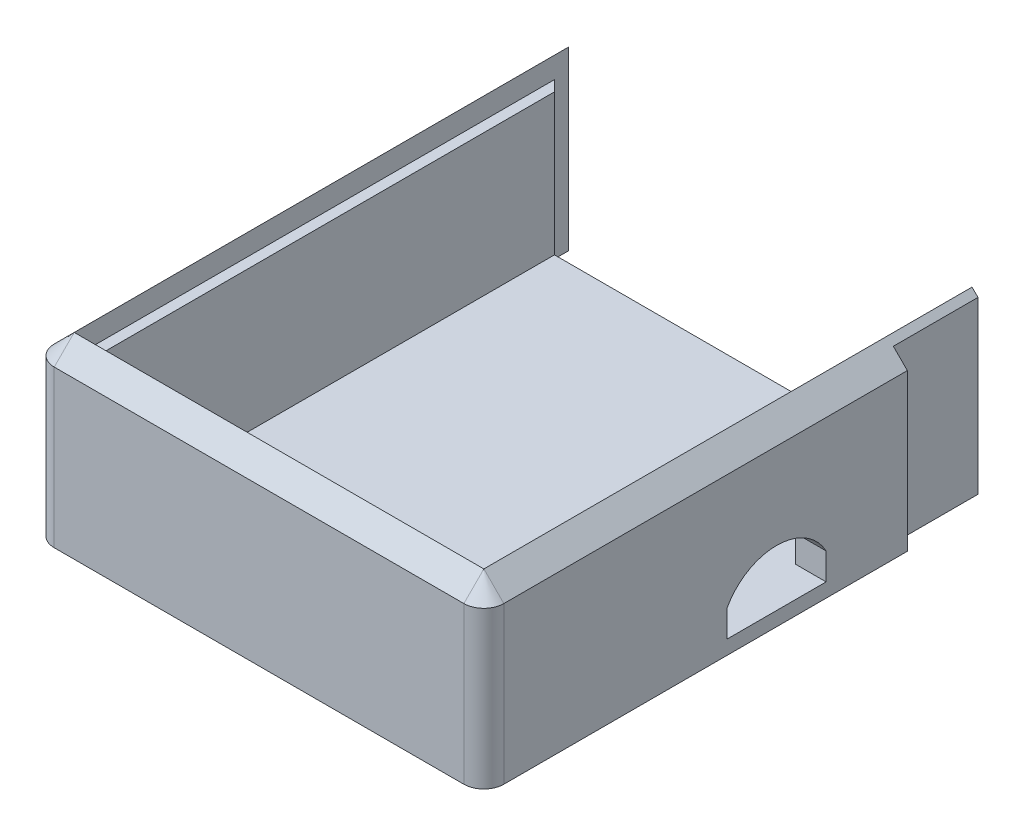
ISO-10303-21;
HEADER;
FILE_DESCRIPTION(('STEP AP214'),'2;1');
FILE_NAME('part.step','',(''),(''),'','','');
FILE_SCHEMA(('AUTOMOTIVE_DESIGN { 1 0 10303 214 1 1 1 1 }'));
ENDSEC;
DATA;
#1=APPLICATION_CONTEXT('core data for automotive mechanical design processes');
#2=APPLICATION_PROTOCOL_DEFINITION('international standard','automotive_design',2000,#1);
#3=PRODUCT_CONTEXT('',#1,'mechanical');
#4=PRODUCT('Part','Part','',(#3));
#5=PRODUCT_RELATED_PRODUCT_CATEGORY('part','',(#4));
#6=PRODUCT_DEFINITION_FORMATION('','',#4);
#7=PRODUCT_DEFINITION_CONTEXT('part definition',#1,'design');
#8=PRODUCT_DEFINITION('design','',#6,#7);
#9=PRODUCT_DEFINITION_SHAPE('','',#8);
#10=(LENGTH_UNIT() NAMED_UNIT(*) SI_UNIT(.MILLI.,.METRE.));
#11=(NAMED_UNIT(*) PLANE_ANGLE_UNIT() SI_UNIT($,.RADIAN.));
#12=(NAMED_UNIT(*) SI_UNIT($,.STERADIAN.) SOLID_ANGLE_UNIT());
#13=UNCERTAINTY_MEASURE_WITH_UNIT(LENGTH_MEASURE(1.E-05),#10,'distance_accuracy_value','');
#14=(GEOMETRIC_REPRESENTATION_CONTEXT(3) GLOBAL_UNCERTAINTY_ASSIGNED_CONTEXT((#13)) GLOBAL_UNIT_ASSIGNED_CONTEXT((#10,
#11,#12)) REPRESENTATION_CONTEXT('',''));
#15=CARTESIAN_POINT('',(0.,0.,0.));
#16=DIRECTION('',(0.,0.,1.));
#17=DIRECTION('',(1.,0.,0.));
#18=AXIS2_PLACEMENT_3D('',#15,#16,#17);
#19=CARTESIAN_POINT('',(0.,0.,0.));
#20=DIRECTION('',(0.,-1.,0.));
#21=DIRECTION('',(0.,0.,-1.));
#22=AXIS2_PLACEMENT_3D('',#19,#20,#21);
#23=PLANE('',#22);
#24=DIRECTION('',(0.,0.,1.));
#25=VECTOR('',#24,1.);
#26=CARTESIAN_POINT('',(77.8803418803419,0.,-114.630116989254));
#27=LINE('',#26,#25);
#28=CARTESIAN_POINT('',(77.8803418803434,0.,-138.245622180952));
#29=VERTEX_POINT('',#28);
#30=CARTESIAN_POINT('',(77.8803418803419,0.,0.));
#31=VERTEX_POINT('',#30);
#32=EDGE_CURVE('E325',#29,#31,#27,.T.);
#33=ORIENTED_EDGE('',*,*,#32,.F.);
#34=DIRECTION('',(1.,0.,0.));
#35=VECTOR('',#34,1.);
#36=CARTESIAN_POINT('',(74.8803418803419,0.,-138.245622180952));
#37=LINE('',#36,#35);
#38=CARTESIAN_POINT('',(74.8803418803419,0.,-138.245622180952));
#39=VERTEX_POINT('',#38);
#40=EDGE_CURVE('E329',#39,#29,#37,.T.);
#41=ORIENTED_EDGE('',*,*,#40,.F.);
#42=DIRECTION('',(0.,0.,-1.));
#43=VECTOR('',#42,1.);
#44=CARTESIAN_POINT('',(74.8803418803419,0.,-111.677295904729));
#45=LINE('',#44,#43);
#46=CARTESIAN_POINT('',(74.8803418803419,0.,-3.));
#47=VERTEX_POINT('',#46);
#48=EDGE_CURVE('E304',#47,#39,#45,.T.);
#49=ORIENTED_EDGE('',*,*,#48,.F.);
#50=DIRECTION('',(1.,0.,0.));
#51=VECTOR('',#50,1.);
#52=CARTESIAN_POINT('',(-35.1196581196581,0.,-3.00000000000001));
#53=LINE('',#52,#51);
#54=CARTESIAN_POINT('',(-35.1196581196581,0.,-3.));
#55=VERTEX_POINT('',#54);
#56=EDGE_CURVE('E311',#55,#47,#53,.T.);
#57=ORIENTED_EDGE('',*,*,#56,.F.);
#58=DIRECTION('',(0.,0.,1.));
#59=VECTOR('',#58,1.);
#60=CARTESIAN_POINT('',(-35.1196581196581,0.,-133.));
#61=LINE('',#60,#59);
#62=CARTESIAN_POINT('',(-35.1196581196581,0.,-133.));
#63=VERTEX_POINT('',#62);
#64=EDGE_CURVE('E306',#63,#55,#61,.T.);
#65=ORIENTED_EDGE('',*,*,#64,.F.);
#66=DIRECTION('',(0.707106781186552,0.,0.707106781186543));
#67=VECTOR('',#66,1.);
#68=CARTESIAN_POINT('',(-35.1196581196581,0.,-133.));
#69=LINE('',#68,#67);
#70=CARTESIAN_POINT('',(-38.1196581196581,0.,-136.));
#71=VERTEX_POINT('',#70);
#72=EDGE_CURVE('E299',#71,#63,#69,.T.);
#73=ORIENTED_EDGE('',*,*,#72,.F.);
#74=DIRECTION('',(0.,0.,1.));
#75=VECTOR('',#74,1.);
#76=CARTESIAN_POINT('',(-38.1196581196581,0.,-146.606601717798));
#77=LINE('',#76,#75);
#78=CARTESIAN_POINT('',(-38.1196581196581,0.,0.));
#79=VERTEX_POINT('',#78);
#80=EDGE_CURVE('E333',#71,#79,#77,.T.);
#81=ORIENTED_EDGE('',*,*,#80,.T.);
#82=DIRECTION('',(-1.,0.,0.));
#83=VECTOR('',#82,1.);
#84=CARTESIAN_POINT('',(88.4869435981401,0.,0.));
#85=LINE('',#84,#83);
#86=EDGE_CURVE('E303',#31,#79,#85,.T.);
#87=ORIENTED_EDGE('',*,*,#86,.F.);
#88=EDGE_LOOP('',(#33,#41,#49,#57,#65,#73,#81,#87));
#89=FACE_BOUND('',#88,.T.);
#90=ADVANCED_FACE('F40',(#89),#23,.F.);
#91=CARTESIAN_POINT('',(0.,0.,-114.272444813001));
#92=DIRECTION('',(0.,0.,1.));
#93=DIRECTION('',(1.,0.,0.));
#94=AXIS2_PLACEMENT_3D('',#91,#92,#93);
#95=PLANE('',#94);
#96=DIRECTION('',(0.,-1.,0.));
#97=VECTOR('',#96,1.);
#98=CARTESIAN_POINT('',(79.5677103220565,0.,-114.272444813001));
#99=LINE('',#98,#97);
#100=CARTESIAN_POINT('',(79.5677103220565,4.31263155828464,-114.272444813001));
#101=VERTEX_POINT('',#100);
#102=CARTESIAN_POINT('',(79.5677103220564,-43.980367935062,-114.272444813001));
#103=VERTEX_POINT('',#102);
#104=EDGE_CURVE('E337',#101,#103,#99,.T.);
#105=ORIENTED_EDGE('',*,*,#104,.F.);
#106=DIRECTION('',(0.707106781186548,-0.707106781186547,0.));
#107=VECTOR('',#106,1.);
#108=CARTESIAN_POINT('',(77.880341880342,5.99999999999909,-114.272444813001));
#109=LINE('',#108,#107);
#110=CARTESIAN_POINT('',(83.54164655305,0.338695327291095,-114.272444813001));
#111=VERTEX_POINT('',#110);
#112=EDGE_CURVE('E322',#101,#111,#109,.T.);
#113=ORIENTED_EDGE('',*,*,#112,.T.);
#114=DIRECTION('',(0.,-1.,0.));
#115=VECTOR('',#114,1.);
#116=CARTESIAN_POINT('',(83.54164655305,0.338695327291095,-114.272444813001));
#117=LINE('',#116,#115);
#118=CARTESIAN_POINT('',(83.54164655305,-43.980367935062,-114.272444813001));
#119=VERTEX_POINT('',#118);
#120=EDGE_CURVE('E316',#111,#119,#117,.T.);
#121=ORIENTED_EDGE('',*,*,#120,.T.);
#122=DIRECTION('',(1.,0.,0.));
#123=VECTOR('',#122,1.);
#124=CARTESIAN_POINT('',(79.5677103220564,-43.980367935062,-114.272444813001));
#125=LINE('',#124,#123);
#126=EDGE_CURVE('E287',#103,#119,#125,.T.);
#127=ORIENTED_EDGE('',*,*,#126,.F.);
#128=EDGE_LOOP('',(#105,#113,#121,#127));
#129=FACE_BOUND('',#128,.T.);
#130=ADVANCED_FACE('F382',(#129),#95,.F.);
#131=CARTESIAN_POINT('',(77.8803418803419,0.,-114.272444813001));
#132=DIRECTION('',(1.,0.,0.));
#133=DIRECTION('',(0.,1.,0.));
#134=AXIS2_PLACEMENT_3D('',#131,#132,#133);
#135=PLANE('',#134);
#136=ORIENTED_EDGE('',*,*,#32,.T.);
#137=DIRECTION('',(0.,1.,0.));
#138=VECTOR('',#137,1.);
#139=CARTESIAN_POINT('',(77.8803418803419,0.,0.));
#140=LINE('',#139,#138);
#141=CARTESIAN_POINT('',(77.880341880342,5.99999999999903,0.));
#142=VERTEX_POINT('',#141);
#143=EDGE_CURVE('E328',#31,#142,#140,.T.);
#144=ORIENTED_EDGE('',*,*,#143,.T.);
#145=DIRECTION('',(0.,0.,1.));
#146=VECTOR('',#145,1.);
#147=CARTESIAN_POINT('',(77.880341880342,5.99999999999909,-114.272444813001));
#148=LINE('',#147,#146);
#149=CARTESIAN_POINT('',(77.8803418803434,5.99999999999773,-138.245622180952));
#150=VERTEX_POINT('',#149);
#151=EDGE_CURVE('E371',#150,#142,#148,.T.);
#152=ORIENTED_EDGE('',*,*,#151,.F.);
#153=DIRECTION('',(0.,-1.,0.));
#154=VECTOR('',#153,1.);
#155=CARTESIAN_POINT('',(77.8803418803434,34.1660941564165,-138.245622180952));
#156=LINE('',#155,#154);
#157=EDGE_CURVE('E226',#150,#29,#156,.T.);
#158=ORIENTED_EDGE('',*,*,#157,.T.);
#159=EDGE_LOOP('',(#136,#144,#152,#158));
#160=FACE_BOUND('',#159,.T.);
#161=ADVANCED_FACE('F438',(#160),#135,.F.);
#162=CARTESIAN_POINT('',(-35.1196581196581,-14.980367935062,-133.));
#163=DIRECTION('',(0.,0.,-1.));
#164=DIRECTION('',(-1.,0.,0.));
#165=AXIS2_PLACEMENT_3D('',#162,#163,#164);
#166=PLANE('',#165);
#167=DIRECTION('',(0.,-1.,0.));
#168=VECTOR('',#167,1.);
#169=CARTESIAN_POINT('',(-35.1196581196581,-14.980367935062,-133.));
#170=LINE('',#169,#168);
#171=CARTESIAN_POINT('',(-35.1196581196581,-39.980367935062,-133.));
#172=VERTEX_POINT('',#171);
#173=CARTESIAN_POINT('',(-35.1196581196581,-43.980367935062,-133.));
#174=VERTEX_POINT('',#173);
#175=EDGE_CURVE('E315',#172,#174,#170,.T.);
#176=ORIENTED_EDGE('',*,*,#175,.F.);
#177=DIRECTION('',(-1.,0.,0.));
#178=VECTOR('',#177,1.);
#179=CARTESIAN_POINT('',(74.8803418803419,-39.980367935062,-133.));
#180=LINE('',#179,#178);
#181=CARTESIAN_POINT('',(74.8803418803419,-39.980367935062,-133.));
#182=VERTEX_POINT('',#181);
#183=EDGE_CURVE('E261',#182,#172,#180,.T.);
#184=ORIENTED_EDGE('',*,*,#183,.F.);
#185=DIRECTION('',(0.,1.,0.));
#186=VECTOR('',#185,1.);
#187=CARTESIAN_POINT('',(74.8803418803419,-18.990367935062,-133.));
#188=LINE('',#187,#186);
#189=CARTESIAN_POINT('',(74.8803418803419,-43.980367935062,-133.));
#190=VERTEX_POINT('',#189);
#191=EDGE_CURVE('E11',#190,#182,#188,.T.);
#192=ORIENTED_EDGE('',*,*,#191,.F.);
#193=DIRECTION('',(1.,0.,0.));
#194=VECTOR('',#193,1.);
#195=CARTESIAN_POINT('',(-35.1196581196581,-43.980367935062,-133.));
#196=LINE('',#195,#194);
#197=EDGE_CURVE('E275',#174,#190,#196,.T.);
#198=ORIENTED_EDGE('',*,*,#197,.F.);
#199=EDGE_LOOP('',(#176,#184,#192,#198));
#200=FACE_BOUND('',#199,.T.);
#201=ADVANCED_FACE('F422',(#200),#166,.T.);
#202=CARTESIAN_POINT('',(-38.1196581196581,6.00000000000002,0.));
#203=DIRECTION('',(0.,-1.,0.));
#204=DIRECTION('',(1.,0.,0.));
#205=AXIS2_PLACEMENT_3D('',#202,#203,#204);
#206=CONICAL_SURFACE('',#205,0.,0.785398163397477);
#207=DIRECTION('',(0.,-0.707106781186526,0.707106781186569));
#208=VECTOR('',#207,1.);
#209=CARTESIAN_POINT('',(-38.1196581196581,6.00000000000002,0.));
#210=LINE('',#209,#208);
#211=CARTESIAN_POINT('',(-38.1196581196581,6.00000000000002,0.));
#212=VERTEX_POINT('',#211);
#213=CARTESIAN_POINT('',(-38.1196581196581,0.338695327292097,5.66130467270808));
#214=VERTEX_POINT('',#213);
#215=EDGE_CURVE('E348',#212,#214,#210,.T.);
#216=ORIENTED_EDGE('',*,*,#215,.F.);
#217=DIRECTION('',(0.707106781186572,0.707106781186523,0.));
#218=VECTOR('',#217,1.);
#219=CARTESIAN_POINT('',(-38.1196581196581,6.00000000000002,0.));
#220=LINE('',#219,#218);
#221=CARTESIAN_POINT('',(-43.7809627923662,0.338695327292275,0.));
#222=VERTEX_POINT('',#221);
#223=EDGE_CURVE('E339',#222,#212,#220,.T.);
#224=ORIENTED_EDGE('',*,*,#223,.F.);
#225=CARTESIAN_POINT('',(-38.1196581196581,0.338695327292248,0.));
#226=DIRECTION('',(0.,-1.,0.));
#227=DIRECTION('',(1.,0.,0.));
#228=AXIS2_PLACEMENT_3D('',#225,#226,#227);
#229=CIRCLE('',#228,5.6613046727081);
#230=EDGE_CURVE('E203',#214,#222,#229,.T.);
#231=ORIENTED_EDGE('',*,*,#230,.F.);
#232=EDGE_LOOP('',(#216,#224,#231));
#233=FACE_BOUND('',#232,.T.);
#234=ADVANCED_FACE('F497',(#233),#206,.T.);
#235=CARTESIAN_POINT('',(-38.1196581196581,0.,0.));
#236=DIRECTION('',(0.,-1.,0.));
#237=DIRECTION('',(1.,0.,0.));
#238=AXIS2_PLACEMENT_3D('',#235,#236,#237);
#239=CYLINDRICAL_SURFACE('',#238,5.66130467270809);
#240=ORIENTED_EDGE('',*,*,#230,.T.);
#241=DIRECTION('',(0.,1.,0.));
#242=VECTOR('',#241,1.);
#243=CARTESIAN_POINT('',(-43.7809627923662,-4.25954471401332,0.));
#244=LINE('',#243,#242);
#245=CARTESIAN_POINT('',(-43.7809627923662,-43.980367935062,0.));
#246=VERTEX_POINT('',#245);
#247=EDGE_CURVE('E198',#246,#222,#244,.T.);
#248=ORIENTED_EDGE('',*,*,#247,.F.);
#249=CARTESIAN_POINT('',(-38.1196581196581,-43.980367935062,0.));
#250=DIRECTION('',(0.,-1.,0.));
#251=DIRECTION('',(0.,0.,-1.));
#252=AXIS2_PLACEMENT_3D('',#249,#250,#251);
#253=CIRCLE('',#252,5.66130467270809);
#254=CARTESIAN_POINT('',(-38.1196581196581,-43.980367935062,5.66130467270808));
#255=VERTEX_POINT('',#254);
#256=EDGE_CURVE('E267',#255,#246,#253,.T.);
#257=ORIENTED_EDGE('',*,*,#256,.F.);
#258=DIRECTION('',(0.,-1.,0.));
#259=VECTOR('',#258,1.);
#260=CARTESIAN_POINT('',(-38.1196581196581,0.338695327292248,5.6613046727081));
#261=LINE('',#260,#259);
#262=EDGE_CURVE('E349',#214,#255,#261,.T.);
#263=ORIENTED_EDGE('',*,*,#262,.F.);
#264=EDGE_LOOP('',(#240,#248,#257,#263));
#265=FACE_BOUND('',#264,.T.);
#266=ADVANCED_FACE('F405',(#265),#239,.T.);
#267=CARTESIAN_POINT('',(-38.1196581196581,6.00000000000002,0.));
#268=DIRECTION('',(-0.707106781186523,0.707106781186572,0.));
#269=DIRECTION('',(-0.707106781186572,-0.707106781186523,0.));
#270=AXIS2_PLACEMENT_3D('',#267,#268,#269);
#271=PLANE('',#270);
#272=DIRECTION('',(0.,0.,-1.));
#273=VECTOR('',#272,1.);
#274=CARTESIAN_POINT('',(-38.1196581196581,6.00000000000002,0.));
#275=LINE('',#274,#273);
#276=CARTESIAN_POINT('',(-38.1196581196581,6.00000000000002,-140.002673602889));
#277=VERTEX_POINT('',#276);
#278=EDGE_CURVE('E216',#212,#277,#275,.T.);
#279=ORIENTED_EDGE('',*,*,#278,.T.);
#280=DIRECTION('',(-0.70710674644611,-0.707106746446062,0.000313465885202374));
#281=VECTOR('',#280,1.);
#282=CARTESIAN_POINT('',(-43.7698155082269,0.349842611431554,-140.000168844454));
#283=LINE('',#282,#281);
#284=CARTESIAN_POINT('',(-43.7809627923662,0.338695327292275,-140.000163902777));
#285=VERTEX_POINT('',#284);
#286=EDGE_CURVE('E209',#277,#285,#283,.T.);
#287=ORIENTED_EDGE('',*,*,#286,.T.);
#288=DIRECTION('',(0.,0.,-1.));
#289=VECTOR('',#288,1.);
#290=CARTESIAN_POINT('',(-43.7809627923662,0.338695327292275,0.));
#291=LINE('',#290,#289);
#292=EDGE_CURVE('E193',#222,#285,#291,.T.);
#293=ORIENTED_EDGE('',*,*,#292,.F.);
#294=ORIENTED_EDGE('',*,*,#223,.T.);
#295=EDGE_LOOP('',(#279,#287,#293,#294));
#296=FACE_BOUND('',#295,.T.);
#297=ADVANCED_FACE('F214',(#296),#271,.T.);
#298=CARTESIAN_POINT('',(-43.7809627923662,-4.25954471401332,0.));
#299=DIRECTION('',(-1.,0.,0.));
#300=DIRECTION('',(0.,0.,1.));
#301=AXIS2_PLACEMENT_3D('',#298,#299,#300);
#302=PLANE('',#301);
#303=ORIENTED_EDGE('',*,*,#292,.T.);
#304=DIRECTION('',(0.,-0.999999901739144,0.000443307684425078));
#305=VECTOR('',#304,1.);
#306=CARTESIAN_POINT('',(-43.7809627923662,-43.9580646593158,-139.980526806751));
#307=LINE('',#306,#305);
#308=CARTESIAN_POINT('',(-43.7809627923662,-43.980367935062,-139.980516919536));
#309=VERTEX_POINT('',#308);
#310=EDGE_CURVE('E197',#285,#309,#307,.T.);
#311=ORIENTED_EDGE('',*,*,#310,.T.);
#312=DIRECTION('',(0.,0.,-1.));
#313=VECTOR('',#312,1.);
#314=CARTESIAN_POINT('',(-43.7809627923662,-43.980367935062,0.));
#315=LINE('',#314,#313);
#316=EDGE_CURVE('E270',#246,#309,#315,.T.);
#317=ORIENTED_EDGE('',*,*,#316,.F.);
#318=ORIENTED_EDGE('',*,*,#247,.T.);
#319=EDGE_LOOP('',(#303,#311,#317,#318));
#320=FACE_BOUND('',#319,.T.);
#321=ADVANCED_FACE('F195',(#320),#302,.T.);
#322=CARTESIAN_POINT('',(77.8803418803419,0.338695327291157,5.66130467270807));
#323=DIRECTION('',(0.,-0.70710678118656,-0.707106781186535));
#324=DIRECTION('',(0.,0.707106781186535,-0.70710678118656));
#325=AXIS2_PLACEMENT_3D('',#322,#323,#324);
#326=PLANE('',#325);
#327=ORIENTED_EDGE('',*,*,#215,.T.);
#328=DIRECTION('',(-1.,0.,0.));
#329=VECTOR('',#328,1.);
#330=CARTESIAN_POINT('',(77.8803418803419,0.338695327291157,5.66130467270807));
#331=LINE('',#330,#329);
#332=CARTESIAN_POINT('',(77.8803418803419,0.338695327291157,5.66130467270807));
#333=VERTEX_POINT('',#332);
#334=EDGE_CURVE('E351',#333,#214,#331,.T.);
#335=ORIENTED_EDGE('',*,*,#334,.F.);
#336=DIRECTION('',(0.,-0.707106781186535,0.70710678118656));
#337=VECTOR('',#336,1.);
#338=CARTESIAN_POINT('',(77.8803418803419,0.338695327291157,5.66130467270807));
#339=LINE('',#338,#337);
#340=EDGE_CURVE('E364',#142,#333,#339,.T.);
#341=ORIENTED_EDGE('',*,*,#340,.F.);
#342=DIRECTION('',(-1.,0.,0.));
#343=VECTOR('',#342,1.);
#344=CARTESIAN_POINT('',(77.880341880342,5.99999999999903,0.));
#345=LINE('',#344,#343);
#346=EDGE_CURVE('E352',#142,#212,#345,.T.);
#347=ORIENTED_EDGE('',*,*,#346,.T.);
#348=EDGE_LOOP('',(#327,#335,#341,#347));
#349=FACE_BOUND('',#348,.T.);
#350=ADVANCED_FACE('F504',(#349),#326,.F.);
#351=CARTESIAN_POINT('',(77.8803418803419,-4.25954471401366,5.66130467270809));
#352=DIRECTION('',(0.,0.,-1.));
#353=DIRECTION('',(0.,1.,0.));
#354=AXIS2_PLACEMENT_3D('',#351,#352,#353);
#355=PLANE('',#354);
#356=ORIENTED_EDGE('',*,*,#262,.T.);
#357=DIRECTION('',(-1.,0.,0.));
#358=VECTOR('',#357,1.);
#359=CARTESIAN_POINT('',(77.8803418803419,-43.980367935062,5.66130467270808));
#360=LINE('',#359,#358);
#361=CARTESIAN_POINT('',(77.8803418803419,-43.980367935062,5.66130467270808));
#362=VERTEX_POINT('',#361);
#363=EDGE_CURVE('E296',#362,#255,#360,.T.);
#364=ORIENTED_EDGE('',*,*,#363,.F.);
#365=DIRECTION('',(0.,-1.,0.));
#366=VECTOR('',#365,1.);
#367=CARTESIAN_POINT('',(77.8803418803419,-4.25954471401366,5.66130467270809));
#368=LINE('',#367,#366);
#369=EDGE_CURVE('E359',#333,#362,#368,.T.);
#370=ORIENTED_EDGE('',*,*,#369,.F.);
#371=ORIENTED_EDGE('',*,*,#334,.T.);
#372=EDGE_LOOP('',(#356,#364,#370,#371));
#373=FACE_BOUND('',#372,.T.);
#374=ADVANCED_FACE('F402',(#373),#355,.F.);
#375=CARTESIAN_POINT('',(-35.1196581196581,178.751223772035,-3.00000000000001));
#376=DIRECTION('',(0.,0.,-1.));
#377=DIRECTION('',(-1.,0.,0.));
#378=AXIS2_PLACEMENT_3D('',#375,#376,#377);
#379=PLANE('',#378);
#380=DIRECTION('',(0.,-1.,0.));
#381=VECTOR('',#380,1.);
#382=CARTESIAN_POINT('',(74.8803418803419,178.751223772035,-3.));
#383=LINE('',#382,#381);
#384=CARTESIAN_POINT('',(74.8803418803419,-39.980367935062,-3.));
#385=VERTEX_POINT('',#384);
#386=EDGE_CURVE('E308',#47,#385,#383,.T.);
#387=ORIENTED_EDGE('',*,*,#386,.T.);
#388=DIRECTION('',(1.,0.,0.));
#389=VECTOR('',#388,1.);
#390=CARTESIAN_POINT('',(-35.1196581196581,-39.980367935062,-3.00000000000001));
#391=LINE('',#390,#389);
#392=CARTESIAN_POINT('',(-35.1196581196581,-39.980367935062,-3.00000000000001));
#393=VERTEX_POINT('',#392);
#394=EDGE_CURVE('E254',#393,#385,#391,.T.);
#395=ORIENTED_EDGE('',*,*,#394,.F.);
#396=DIRECTION('',(0.,-1.,0.));
#397=VECTOR('',#396,1.);
#398=CARTESIAN_POINT('',(-35.1196581196581,178.751223772035,-3.00000000000001));
#399=LINE('',#398,#397);
#400=EDGE_CURVE('E312',#55,#393,#399,.T.);
#401=ORIENTED_EDGE('',*,*,#400,.F.);
#402=ORIENTED_EDGE('',*,*,#56,.T.);
#403=EDGE_LOOP('',(#387,#395,#401,#402));
#404=FACE_BOUND('',#403,.T.);
#405=ADVANCED_FACE('F483',(#404),#379,.T.);
#406=CARTESIAN_POINT('',(-35.1196581196581,178.751223772035,-133.));
#407=DIRECTION('',(1.,0.,0.));
#408=DIRECTION('',(0.,0.,-1.));
#409=AXIS2_PLACEMENT_3D('',#406,#407,#408);
#410=PLANE('',#409);
#411=ORIENTED_EDGE('',*,*,#400,.T.);
#412=DIRECTION('',(0.,0.,1.));
#413=VECTOR('',#412,1.);
#414=CARTESIAN_POINT('',(-35.1196581196581,-39.980367935062,-133.));
#415=LINE('',#414,#413);
#416=EDGE_CURVE('E264',#172,#393,#415,.T.);
#417=ORIENTED_EDGE('',*,*,#416,.F.);
#418=DIRECTION('',(0.,-1.,0.));
#419=VECTOR('',#418,1.);
#420=CARTESIAN_POINT('',(-35.1196581196581,178.751223772035,-133.));
#421=LINE('',#420,#419);
#422=EDGE_CURVE('E313',#63,#172,#421,.T.);
#423=ORIENTED_EDGE('',*,*,#422,.F.);
#424=ORIENTED_EDGE('',*,*,#64,.T.);
#425=EDGE_LOOP('',(#411,#417,#423,#424));
#426=FACE_BOUND('',#425,.T.);
#427=ADVANCED_FACE('F449',(#426),#410,.T.);
#428=CARTESIAN_POINT('',(74.8803418803419,178.751223772035,-111.677295904729));
#429=DIRECTION('',(-1.,0.,0.));
#430=DIRECTION('',(0.,0.,1.));
#431=AXIS2_PLACEMENT_3D('',#428,#429,#430);
#432=PLANE('',#431);
#433=ORIENTED_EDGE('',*,*,#48,.T.);
#434=DIRECTION('',(0.,1.,0.));
#435=VECTOR('',#434,1.);
#436=CARTESIAN_POINT('',(74.8803418803419,-7.98036793506195,-138.245622180952));
#437=LINE('',#436,#435);
#438=CARTESIAN_POINT('',(74.8803418803419,-43.980367935062,-138.245622180952));
#439=VERTEX_POINT('',#438);
#440=EDGE_CURVE('E332',#439,#39,#437,.T.);
#441=ORIENTED_EDGE('',*,*,#440,.F.);
#442=DIRECTION('',(0.,0.,-1.));
#443=VECTOR('',#442,1.);
#444=CARTESIAN_POINT('',(74.8803418803419,-43.980367935062,-133.));
#445=LINE('',#444,#443);
#446=EDGE_CURVE('E278',#190,#439,#445,.T.);
#447=ORIENTED_EDGE('',*,*,#446,.F.);
#448=ORIENTED_EDGE('',*,*,#191,.T.);
#449=DIRECTION('',(0.,0.,-1.));
#450=VECTOR('',#449,1.);
#451=CARTESIAN_POINT('',(74.8803418803419,-39.980367935062,-91.2605323596572));
#452=LINE('',#451,#450);
#453=CARTESIAN_POINT('',(74.8803418803419,-39.9803672726107,-91.2605323596572));
#454=VERTEX_POINT('',#453);
#455=EDGE_CURVE('E257',#454,#182,#452,.T.);
#456=ORIENTED_EDGE('',*,*,#455,.F.);
#457=DIRECTION('',(0.,-1.,0.));
#458=VECTOR('',#457,1.);
#459=CARTESIAN_POINT('',(74.8803418803419,178.751223772035,-91.2605323596572));
#460=LINE('',#459,#458);
#461=CARTESIAN_POINT('',(74.8803418803419,-32.3849171067868,-91.2605323596572));
#462=VERTEX_POINT('',#461);
#463=EDGE_CURVE('E244',#462,#454,#460,.T.);
#464=ORIENTED_EDGE('',*,*,#463,.F.);
#465=CARTESIAN_POINT('',(74.8803418803419,-39.9803672726107,-77.2330629938219));
#466=DIRECTION('',(-1.,0.,0.));
#467=DIRECTION('',(0.,0.,1.));
#468=AXIS2_PLACEMENT_3D('',#465,#466,#467);
#469=CIRCLE('',#468,15.9518262287101);
#470=CARTESIAN_POINT('',(74.8803418803419,-32.3849171067869,-63.2055936279866));
#471=VERTEX_POINT('',#470);
#472=EDGE_CURVE('E252',#471,#462,#469,.T.);
#473=ORIENTED_EDGE('',*,*,#472,.F.);
#474=DIRECTION('',(0.,1.,0.));
#475=VECTOR('',#474,1.);
#476=CARTESIAN_POINT('',(74.8803418803419,178.751223772035,-63.2055936279866));
#477=LINE('',#476,#475);
#478=CARTESIAN_POINT('',(74.8803418803419,-39.9803672726107,-63.2055936279866));
#479=VERTEX_POINT('',#478);
#480=EDGE_CURVE('E250',#479,#471,#477,.T.);
#481=ORIENTED_EDGE('',*,*,#480,.F.);
#482=EDGE_CURVE('E258',#385,#479,#452,.T.);
#483=ORIENTED_EDGE('',*,*,#482,.F.);
#484=ORIENTED_EDGE('',*,*,#386,.F.);
#485=EDGE_LOOP('',(#433,#441,#447,#448,#456,#464,#473,#481,#483,#484));
#486=FACE_BOUND('',#485,.T.);
#487=ADVANCED_FACE('F426',(#486),#432,.T.);
#488=CARTESIAN_POINT('',(-38.1196581196581,0.,-136.));
#489=DIRECTION('',(-0.707106781186544,0.,0.707106781186551));
#490=DIRECTION('',(0.707106781186551,0.,0.707106781186544));
#491=AXIS2_PLACEMENT_3D('',#488,#489,#490);
#492=PLANE('',#491);
#493=ORIENTED_EDGE('',*,*,#422,.T.);
#494=ORIENTED_EDGE('',*,*,#175,.T.);
#495=DIRECTION('',(0.707106781186552,0.,0.707106781186543));
#496=VECTOR('',#495,1.);
#497=CARTESIAN_POINT('',(-38.1196581196581,-43.980367935062,-136.));
#498=LINE('',#497,#496);
#499=CARTESIAN_POINT('',(-38.1196581196581,-43.980367935062,-136.));
#500=VERTEX_POINT('',#499);
#501=EDGE_CURVE('E272',#500,#174,#498,.T.);
#502=ORIENTED_EDGE('',*,*,#501,.F.);
#503=DIRECTION('',(0.,1.,0.));
#504=VECTOR('',#503,1.);
#505=CARTESIAN_POINT('',(-38.1196581196581,-1.75952117227556,-136.));
#506=LINE('',#505,#504);
#507=EDGE_CURVE('E301',#500,#71,#506,.T.);
#508=ORIENTED_EDGE('',*,*,#507,.T.);
#509=ORIENTED_EDGE('',*,*,#72,.T.);
#510=EDGE_LOOP('',(#493,#494,#502,#508,#509));
#511=FACE_BOUND('',#510,.T.);
#512=ADVANCED_FACE('F417',(#511),#492,.F.);
#513=CARTESIAN_POINT('',(77.880341880342,5.99999999999903,0.));
#514=DIRECTION('',(0.,-1.,0.));
#515=DIRECTION('',(1.,0.,0.));
#516=AXIS2_PLACEMENT_3D('',#513,#514,#515);
#517=CONICAL_SURFACE('',#516,0.,0.785398163397465);
#518=DIRECTION('',(0.707106781186553,-0.707106781186542,0.));
#519=VECTOR('',#518,1.);
#520=CARTESIAN_POINT('',(77.880341880342,5.99999999999903,0.));
#521=LINE('',#520,#519);
#522=CARTESIAN_POINT('',(83.54164655305,0.338695327291081,0.));
#523=VERTEX_POINT('',#522);
#524=EDGE_CURVE('E327',#142,#523,#521,.T.);
#525=ORIENTED_EDGE('',*,*,#524,.F.);
#526=ORIENTED_EDGE('',*,*,#340,.T.);
#527=CARTESIAN_POINT('',(77.8803418803419,0.33869532729115,0.));
#528=DIRECTION('',(0.,-1.,0.));
#529=DIRECTION('',(1.,0.,0.));
#530=AXIS2_PLACEMENT_3D('',#527,#528,#529);
#531=CIRCLE('',#530,5.66130467270809);
#532=EDGE_CURVE('E363',#523,#333,#531,.T.);
#533=ORIENTED_EDGE('',*,*,#532,.F.);
#534=EDGE_LOOP('',(#525,#526,#533));
#535=FACE_BOUND('',#534,.T.);
#536=ADVANCED_FACE('F517',(#535),#517,.T.);
#537=CARTESIAN_POINT('',(77.8803418803419,0.,0.));
#538=DIRECTION('',(0.,-1.,0.));
#539=DIRECTION('',(1.,0.,0.));
#540=AXIS2_PLACEMENT_3D('',#537,#538,#539);
#541=CYLINDRICAL_SURFACE('',#540,5.6613046727081);
#542=ORIENTED_EDGE('',*,*,#369,.T.);
#543=CARTESIAN_POINT('',(77.8803418803419,-43.980367935062,0.));
#544=DIRECTION('',(0.,-1.,0.));
#545=DIRECTION('',(0.,0.,-1.));
#546=AXIS2_PLACEMENT_3D('',#543,#544,#545);
#547=CIRCLE('',#546,5.66130467270809);
#548=CARTESIAN_POINT('',(83.54164655305,-43.980367935062,0.));
#549=VERTEX_POINT('',#548);
#550=EDGE_CURVE('E293',#549,#362,#547,.T.);
#551=ORIENTED_EDGE('',*,*,#550,.F.);
#552=DIRECTION('',(0.,-1.,0.));
#553=VECTOR('',#552,1.);
#554=CARTESIAN_POINT('',(83.54164655305,0.338695327291098,0.));
#555=LINE('',#554,#553);
#556=EDGE_CURVE('E372',#523,#549,#555,.T.);
#557=ORIENTED_EDGE('',*,*,#556,.F.);
#558=ORIENTED_EDGE('',*,*,#532,.T.);
#559=EDGE_LOOP('',(#542,#551,#557,#558));
#560=FACE_BOUND('',#559,.T.);
#561=ADVANCED_FACE('F398',(#560),#541,.T.);
#562=CARTESIAN_POINT('',(77.880341880342,5.99999999999909,-114.272444813001));
#563=DIRECTION('',(-0.707106781186547,-0.707106781186548,0.));
#564=DIRECTION('',(0.707106781186548,-0.707106781186547,0.));
#565=AXIS2_PLACEMENT_3D('',#562,#563,#564);
#566=PLANE('',#565);
#567=ORIENTED_EDGE('',*,*,#524,.T.);
#568=DIRECTION('',(0.,0.,1.));
#569=VECTOR('',#568,1.);
#570=CARTESIAN_POINT('',(83.54164655305,0.338695327291095,-114.272444813001));
#571=LINE('',#570,#569);
#572=EDGE_CURVE('E48',#111,#523,#571,.T.);
#573=ORIENTED_EDGE('',*,*,#572,.F.);
#574=ORIENTED_EDGE('',*,*,#112,.F.);
#575=DIRECTION('',(0.,0.,1.));
#576=VECTOR('',#575,1.);
#577=CARTESIAN_POINT('',(79.5677103220565,4.31263155828464,-138.245622180952));
#578=LINE('',#577,#576);
#579=CARTESIAN_POINT('',(79.5677103220565,4.31263155828464,-138.245622180952));
#580=VERTEX_POINT('',#579);
#581=EDGE_CURVE('E225',#580,#101,#578,.T.);
#582=ORIENTED_EDGE('',*,*,#581,.F.);
#583=DIRECTION('',(0.707106781186548,-0.707106781186547,0.));
#584=VECTOR('',#583,1.);
#585=CARTESIAN_POINT('',(63.7972948021339,20.0830470782071,-138.245622180952));
#586=LINE('',#585,#584);
#587=EDGE_CURVE('E222',#150,#580,#586,.T.);
#588=ORIENTED_EDGE('',*,*,#587,.F.);
#589=ORIENTED_EDGE('',*,*,#151,.T.);
#590=EDGE_LOOP('',(#567,#573,#574,#582,#588,#589));
#591=FACE_BOUND('',#590,.T.);
#592=ADVANCED_FACE('F387',(#591),#566,.F.);
#593=CARTESIAN_POINT('',(83.54164655305,0.338695327291095,-114.272444813001));
#594=DIRECTION('',(-1.,0.,0.));
#595=DIRECTION('',(0.,0.,1.));
#596=AXIS2_PLACEMENT_3D('',#593,#594,#595);
#597=PLANE('',#596);
#598=ORIENTED_EDGE('',*,*,#572,.T.);
#599=ORIENTED_EDGE('',*,*,#556,.T.);
#600=DIRECTION('',(0.,0.,1.));
#601=VECTOR('',#600,1.);
#602=CARTESIAN_POINT('',(83.54164655305,-43.980367935062,-114.272444813001));
#603=LINE('',#602,#601);
#604=EDGE_CURVE('E290',#119,#549,#603,.T.);
#605=ORIENTED_EDGE('',*,*,#604,.F.);
#606=ORIENTED_EDGE('',*,*,#120,.F.);
#607=EDGE_LOOP('',(#598,#599,#605,#606));
#608=FACE_BOUND('',#607,.T.);
#609=DIRECTION('',(0.,1.,0.));
#610=VECTOR('',#609,1.);
#611=CARTESIAN_POINT('',(83.54164655305,-32.3849171067869,-91.2605323596572));
#612=LINE('',#611,#610);
#613=CARTESIAN_POINT('',(83.54164655305,-39.9803672726107,-91.2605323596572));
#614=VERTEX_POINT('',#613);
#615=CARTESIAN_POINT('',(83.54164655305,-32.3849171067869,-91.2605323596572));
#616=VERTEX_POINT('',#615);
#617=EDGE_CURVE('E233',#614,#616,#612,.T.);
#618=ORIENTED_EDGE('',*,*,#617,.F.);
#619=DIRECTION('',(0.,0.,-1.));
#620=VECTOR('',#619,1.);
#621=CARTESIAN_POINT('',(83.54164655305,-39.9803672726107,-63.2055936279866));
#622=LINE('',#621,#620);
#623=CARTESIAN_POINT('',(83.54164655305,-39.9803672726107,-63.2055936279866));
#624=VERTEX_POINT('',#623);
#625=EDGE_CURVE('E63',#624,#614,#622,.T.);
#626=ORIENTED_EDGE('',*,*,#625,.F.);
#627=DIRECTION('',(0.,-1.,0.));
#628=VECTOR('',#627,1.);
#629=CARTESIAN_POINT('',(83.54164655305,-32.3849171067869,-63.2055936279866));
#630=LINE('',#629,#628);
#631=CARTESIAN_POINT('',(83.54164655305,-32.3849171067869,-63.2055936279866));
#632=VERTEX_POINT('',#631);
#633=EDGE_CURVE('E238',#632,#624,#630,.T.);
#634=ORIENTED_EDGE('',*,*,#633,.F.);
#635=CARTESIAN_POINT('',(83.54164655305,-39.9803672726107,-77.2330629938219));
#636=DIRECTION('',(1.,0.,0.));
#637=DIRECTION('',(0.,0.,1.));
#638=AXIS2_PLACEMENT_3D('',#635,#636,#637);
#639=CIRCLE('',#638,15.9518262287101);
#640=EDGE_CURVE('E235',#616,#632,#639,.T.);
#641=ORIENTED_EDGE('',*,*,#640,.F.);
#642=EDGE_LOOP('',(#618,#626,#634,#641));
#643=FACE_BOUND('',#642,.T.);
#644=ADVANCED_FACE('F42',(#608,#643),#597,.F.);
#645=CARTESIAN_POINT('',(77.880341880342,5.99999999999903,0.));
#646=DIRECTION('',(0.,0.,1.));
#647=DIRECTION('',(0.,-1.,0.));
#648=AXIS2_PLACEMENT_3D('',#645,#646,#647);
#649=PLANE('',#648);
#650=ORIENTED_EDGE('',*,*,#143,.F.);
#651=ORIENTED_EDGE('',*,*,#86,.T.);
#652=DIRECTION('',(0.,1.,0.));
#653=VECTOR('',#652,1.);
#654=CARTESIAN_POINT('',(-38.119658119658,5.99999999999997,0.));
#655=LINE('',#654,#653);
#656=EDGE_CURVE('E307',#79,#212,#655,.T.);
#657=ORIENTED_EDGE('',*,*,#656,.T.);
#658=ORIENTED_EDGE('',*,*,#346,.F.);
#659=EDGE_LOOP('',(#650,#651,#657,#658));
#660=FACE_BOUND('',#659,.T.);
#661=ADVANCED_FACE('F443',(#660),#649,.F.);
#662=CARTESIAN_POINT('',(-38.1196581196581,6.00000000000002,0.));
#663=DIRECTION('',(1.,0.,0.));
#664=DIRECTION('',(0.,1.,0.));
#665=AXIS2_PLACEMENT_3D('',#662,#663,#664);
#666=PLANE('',#665);
#667=ORIENTED_EDGE('',*,*,#278,.F.);
#668=ORIENTED_EDGE('',*,*,#656,.F.);
#669=ORIENTED_EDGE('',*,*,#80,.F.);
#670=ORIENTED_EDGE('',*,*,#507,.F.);
#671=DIRECTION('',(0.,0.,1.));
#672=VECTOR('',#671,1.);
#673=CARTESIAN_POINT('',(-38.1196581196581,-43.980367935062,-190.291573373832));
#674=LINE('',#673,#672);
#675=CARTESIAN_POINT('',(-38.1196581196581,-43.980367935062,-139.980516919536));
#676=VERTEX_POINT('',#675);
#677=EDGE_CURVE('E217',#676,#500,#674,.T.);
#678=ORIENTED_EDGE('',*,*,#677,.F.);
#679=DIRECTION('',(0.,0.999999901739144,-0.000443307684425078));
#680=VECTOR('',#679,1.);
#681=CARTESIAN_POINT('',(-38.1196581196581,0.0222946326493807,-140.000023639904));
#682=LINE('',#681,#680);
#683=EDGE_CURVE('E229',#676,#277,#682,.T.);
#684=ORIENTED_EDGE('',*,*,#683,.T.);
#685=EDGE_LOOP('',(#667,#668,#669,#670,#678,#684));
#686=FACE_BOUND('',#685,.T.);
#687=ADVANCED_FACE('F412',(#686),#666,.T.);
#688=CARTESIAN_POINT('',(79.5677103220565,-1.38367530067343E-13,0.));
#689=DIRECTION('',(1.,0.,0.));
#690=DIRECTION('',(0.,1.,0.));
#691=AXIS2_PLACEMENT_3D('',#688,#689,#690);
#692=PLANE('',#691);
#693=DIRECTION('',(0.,1.,0.));
#694=VECTOR('',#693,1.);
#695=CARTESIAN_POINT('',(79.5677103220564,-7.98036793506196,-138.245622180952));
#696=LINE('',#695,#694);
#697=CARTESIAN_POINT('',(79.5677103220564,-43.980367935062,-138.245622180952));
#698=VERTEX_POINT('',#697);
#699=EDGE_CURVE('E336',#698,#580,#696,.T.);
#700=ORIENTED_EDGE('',*,*,#699,.T.);
#701=ORIENTED_EDGE('',*,*,#581,.T.);
#702=ORIENTED_EDGE('',*,*,#104,.T.);
#703=DIRECTION('',(0.,0.,1.));
#704=VECTOR('',#703,1.);
#705=CARTESIAN_POINT('',(79.5677103220564,-43.980367935062,-138.245622180952));
#706=LINE('',#705,#704);
#707=EDGE_CURVE('E284',#698,#103,#706,.T.);
#708=ORIENTED_EDGE('',*,*,#707,.F.);
#709=EDGE_LOOP('',(#700,#701,#702,#708));
#710=FACE_BOUND('',#709,.T.);
#711=ADVANCED_FACE('F436',(#710),#692,.T.);
#712=CARTESIAN_POINT('',(0.,0.,-138.245622180952));
#713=DIRECTION('',(0.,0.,-1.));
#714=DIRECTION('',(-1.,0.,0.));
#715=AXIS2_PLACEMENT_3D('',#712,#713,#714);
#716=PLANE('',#715);
#717=ORIENTED_EDGE('',*,*,#40,.T.);
#718=ORIENTED_EDGE('',*,*,#157,.F.);
#719=ORIENTED_EDGE('',*,*,#587,.T.);
#720=ORIENTED_EDGE('',*,*,#699,.F.);
#721=DIRECTION('',(1.,0.,0.));
#722=VECTOR('',#721,1.);
#723=CARTESIAN_POINT('',(74.8803418803419,-43.980367935062,-138.245622180952));
#724=LINE('',#723,#722);
#725=EDGE_CURVE('E281',#439,#698,#724,.T.);
#726=ORIENTED_EDGE('',*,*,#725,.F.);
#727=ORIENTED_EDGE('',*,*,#440,.T.);
#728=EDGE_LOOP('',(#717,#718,#719,#720,#726,#727));
#729=FACE_BOUND('',#728,.T.);
#730=ADVANCED_FACE('F431',(#729),#716,.T.);
#731=CARTESIAN_POINT('',(-38.1196581196581,-43.980367935062,0.));
#732=DIRECTION('',(0.,-1.,0.));
#733=DIRECTION('',(0.,0.,-1.));
#734=AXIS2_PLACEMENT_3D('',#731,#732,#733);
#735=PLANE('',#734);
#736=ORIENTED_EDGE('',*,*,#256,.T.);
#737=ORIENTED_EDGE('',*,*,#316,.T.);
#738=DIRECTION('',(1.,0.,0.));
#739=VECTOR('',#738,1.);
#740=CARTESIAN_POINT('',(-38.1196581196586,-43.980367935062,-139.980516919536));
#741=LINE('',#740,#739);
#742=EDGE_CURVE('E212',#309,#676,#741,.T.);
#743=ORIENTED_EDGE('',*,*,#742,.T.);
#744=ORIENTED_EDGE('',*,*,#677,.T.);
#745=ORIENTED_EDGE('',*,*,#501,.T.);
#746=ORIENTED_EDGE('',*,*,#197,.T.);
#747=ORIENTED_EDGE('',*,*,#446,.T.);
#748=ORIENTED_EDGE('',*,*,#725,.T.);
#749=ORIENTED_EDGE('',*,*,#707,.T.);
#750=ORIENTED_EDGE('',*,*,#126,.T.);
#751=ORIENTED_EDGE('',*,*,#604,.T.);
#752=ORIENTED_EDGE('',*,*,#550,.T.);
#753=ORIENTED_EDGE('',*,*,#363,.T.);
#754=EDGE_LOOP('',(#736,#737,#743,#744,#745,#746,#747,#748,#749,#750,#751,#752,#753));
#755=FACE_BOUND('',#754,.T.);
#756=ADVANCED_FACE('F395',(#755),#735,.T.);
#757=CARTESIAN_POINT('',(0.,-39.980367935062,0.));
#758=DIRECTION('',(0.,1.,0.));
#759=DIRECTION('',(0.,0.,1.));
#760=AXIS2_PLACEMENT_3D('',#757,#758,#759);
#761=PLANE('',#760);
#762=ORIENTED_EDGE('',*,*,#482,.T.);
#763=DIRECTION('',(1.,0.,0.));
#764=VECTOR('',#763,1.);
#765=CARTESIAN_POINT('',(48.54164655305,-39.9803672726107,-63.2055936279866));
#766=LINE('',#765,#764);
#767=EDGE_CURVE('E242',#479,#624,#766,.T.);
#768=ORIENTED_EDGE('',*,*,#767,.T.);
#769=ORIENTED_EDGE('',*,*,#625,.T.);
#770=DIRECTION('',(1.,0.,0.));
#771=VECTOR('',#770,1.);
#772=CARTESIAN_POINT('',(48.54164655305,-39.9803672726107,-91.2605323596572));
#773=LINE('',#772,#771);
#774=EDGE_CURVE('E241',#454,#614,#773,.T.);
#775=ORIENTED_EDGE('',*,*,#774,.F.);
#776=ORIENTED_EDGE('',*,*,#455,.T.);
#777=ORIENTED_EDGE('',*,*,#183,.T.);
#778=ORIENTED_EDGE('',*,*,#416,.T.);
#779=ORIENTED_EDGE('',*,*,#394,.T.);
#780=EDGE_LOOP('',(#762,#768,#769,#775,#776,#777,#778,#779));
#781=FACE_BOUND('',#780,.T.);
#782=ADVANCED_FACE('F452',(#781),#761,.T.);
#783=CARTESIAN_POINT('',(48.54164655305,-32.3849171067869,-63.2055936279866));
#784=DIRECTION('',(0.,0.,1.));
#785=DIRECTION('',(1.,0.,0.));
#786=AXIS2_PLACEMENT_3D('',#783,#784,#785);
#787=PLANE('',#786);
#788=ORIENTED_EDGE('',*,*,#480,.T.);
#789=DIRECTION('',(1.,0.,0.));
#790=VECTOR('',#789,1.);
#791=CARTESIAN_POINT('',(48.54164655305,-32.3849171067869,-63.2055936279866));
#792=LINE('',#791,#790);
#793=EDGE_CURVE('E245',#471,#632,#792,.T.);
#794=ORIENTED_EDGE('',*,*,#793,.T.);
#795=ORIENTED_EDGE('',*,*,#633,.T.);
#796=ORIENTED_EDGE('',*,*,#767,.F.);
#797=EDGE_LOOP('',(#788,#794,#795,#796));
#798=FACE_BOUND('',#797,.T.);
#799=ADVANCED_FACE('F464',(#798),#787,.F.);
#800=CARTESIAN_POINT('',(48.54164655305,-39.9803672726107,-77.2330629938219));
#801=DIRECTION('',(1.,0.,0.));
#802=DIRECTION('',(0.,0.,-1.));
#803=AXIS2_PLACEMENT_3D('',#800,#801,#802);
#804=CYLINDRICAL_SURFACE('',#803,15.9518262287101);
#805=ORIENTED_EDGE('',*,*,#472,.T.);
#806=DIRECTION('',(1.,0.,0.));
#807=VECTOR('',#806,1.);
#808=CARTESIAN_POINT('',(48.54164655305,-32.3849171067869,-91.2605323596572));
#809=LINE('',#808,#807);
#810=EDGE_CURVE('E55',#462,#616,#809,.T.);
#811=ORIENTED_EDGE('',*,*,#810,.T.);
#812=ORIENTED_EDGE('',*,*,#640,.T.);
#813=ORIENTED_EDGE('',*,*,#793,.F.);
#814=EDGE_LOOP('',(#805,#811,#812,#813));
#815=FACE_BOUND('',#814,.T.);
#816=ADVANCED_FACE('F459',(#815),#804,.F.);
#817=CARTESIAN_POINT('',(48.54164655305,-32.3849171067869,-91.2605323596572));
#818=DIRECTION('',(0.,0.,-1.));
#819=DIRECTION('',(-1.,0.,0.));
#820=AXIS2_PLACEMENT_3D('',#817,#818,#819);
#821=PLANE('',#820);
#822=ORIENTED_EDGE('',*,*,#463,.T.);
#823=ORIENTED_EDGE('',*,*,#774,.T.);
#824=ORIENTED_EDGE('',*,*,#617,.T.);
#825=ORIENTED_EDGE('',*,*,#810,.F.);
#826=EDGE_LOOP('',(#822,#823,#824,#825));
#827=FACE_BOUND('',#826,.T.);
#828=ADVANCED_FACE('F454',(#827),#821,.F.);
#829=CARTESIAN_POINT('',(63.8694606824788,7.93793554852752,-140.003532704693));
#830=DIRECTION('',(0.,0.000443307684425078,0.999999901739144));
#831=DIRECTION('',(0.,0.999999901739144,-0.000443307684425078));
#832=AXIS2_PLACEMENT_3D('',#829,#830,#831);
#833=PLANE('',#832);
#834=ORIENTED_EDGE('',*,*,#742,.F.);
#835=ORIENTED_EDGE('',*,*,#310,.F.);
#836=ORIENTED_EDGE('',*,*,#286,.F.);
#837=ORIENTED_EDGE('',*,*,#683,.F.);
#838=EDGE_LOOP('',(#834,#835,#836,#837));
#839=FACE_BOUND('',#838,.T.);
#840=ADVANCED_FACE('F208',(#839),#833,.F.);
#841=CLOSED_SHELL('',(#90,#130,#161,#201,#234,#266,#297,#321,#350,#374,#405,#427,#487,#512,#536,
#561,#592,#644,#661,#687,#711,#730,#756,#782,#799,#816,#828,#840));
#842=MANIFOLD_SOLID_BREP('B2',#841);
#843=ADVANCED_BREP_SHAPE_REPRESENTATION('',(#18,#842),#14);
#844=SHAPE_DEFINITION_REPRESENTATION(#9,#843);
ENDSEC;
END-ISO-10303-21;
